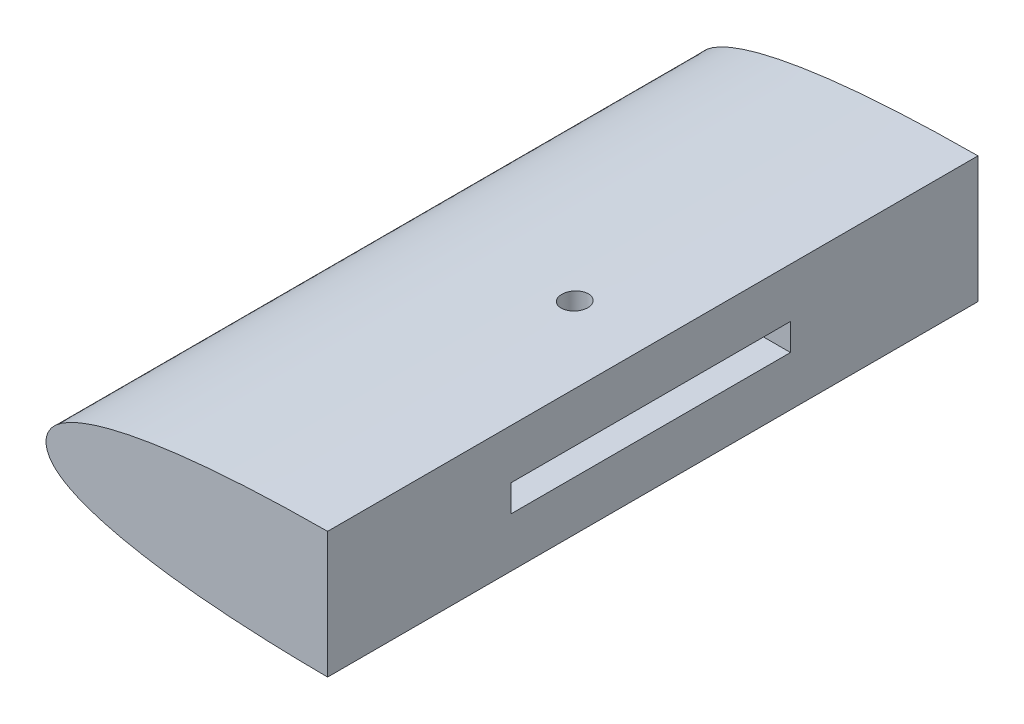
ISO-10303-21;
HEADER;
FILE_DESCRIPTION(('STEP AP214'),'2;1');
FILE_NAME('part.step','',(''),(''),'','','');
FILE_SCHEMA(('AUTOMOTIVE_DESIGN { 1 0 10303 214 1 1 1 1 }'));
ENDSEC;
DATA;
#1=APPLICATION_CONTEXT('core data for automotive mechanical design processes');
#2=APPLICATION_PROTOCOL_DEFINITION('international standard','automotive_design',2000,#1);
#3=PRODUCT_CONTEXT('',#1,'mechanical');
#4=PRODUCT('Part','Part','',(#3));
#5=PRODUCT_RELATED_PRODUCT_CATEGORY('part','',(#4));
#6=PRODUCT_DEFINITION_FORMATION('','',#4);
#7=PRODUCT_DEFINITION_CONTEXT('part definition',#1,'design');
#8=PRODUCT_DEFINITION('design','',#6,#7);
#9=PRODUCT_DEFINITION_SHAPE('','',#8);
#10=(LENGTH_UNIT() NAMED_UNIT(*) SI_UNIT(.MILLI.,.METRE.));
#11=(NAMED_UNIT(*) PLANE_ANGLE_UNIT() SI_UNIT($,.RADIAN.));
#12=(NAMED_UNIT(*) SI_UNIT($,.STERADIAN.) SOLID_ANGLE_UNIT());
#13=UNCERTAINTY_MEASURE_WITH_UNIT(LENGTH_MEASURE(1.E-05),#10,'distance_accuracy_value','');
#14=(GEOMETRIC_REPRESENTATION_CONTEXT(3) GLOBAL_UNCERTAINTY_ASSIGNED_CONTEXT((#13)) GLOBAL_UNIT_ASSIGNED_CONTEXT((#10,
#11,#12)) REPRESENTATION_CONTEXT('',''));
#15=CARTESIAN_POINT('',(0.,0.,0.));
#16=DIRECTION('',(0.,0.,1.));
#17=DIRECTION('',(1.,0.,0.));
#18=AXIS2_PLACEMENT_3D('',#15,#16,#17);
#19=CARTESIAN_POINT('',(30.9490601417906,3.10353900169913,106.75));
#20=DIRECTION('',(0.,1.,0.));
#21=DIRECTION('',(0.,0.,1.));
#22=AXIS2_PLACEMENT_3D('',#19,#20,#21);
#23=PLANE('',#22);
#24=CARTESIAN_POINT('',(46.9490601417906,3.10353900169913,75.));
#25=DIRECTION('',(0.,1.,0.));
#26=DIRECTION('',(0.,0.,1.));
#27=AXIS2_PLACEMENT_3D('',#24,#25,#26);
#28=CIRCLE('',#27,3.);
#29=CARTESIAN_POINT('',(46.9490601417906,3.10353900169913,78.));
#30=VERTEX_POINT('',#29);
#31=EDGE_CURVE('E150',#30,#30,#28,.T.);
#32=ORIENTED_EDGE('',*,*,#31,.T.);
#33=EDGE_LOOP('',(#32));
#34=FACE_BOUND('',#33,.T.);
#35=DIRECTION('',(0.,0.,1.));
#36=VECTOR('',#35,1.);
#37=CARTESIAN_POINT('',(64.9490601417906,3.10353900169913,106.75));
#38=LINE('',#37,#36);
#39=CARTESIAN_POINT('',(64.9490601417906,3.10353900169913,43.25));
#40=VERTEX_POINT('',#39);
#41=CARTESIAN_POINT('',(64.9490601417906,3.10353900169913,107.75));
#42=VERTEX_POINT('',#41);
#43=EDGE_CURVE('E113',#40,#42,#38,.T.);
#44=ORIENTED_EDGE('',*,*,#43,.T.);
#45=DIRECTION('',(1.,0.,0.));
#46=VECTOR('',#45,1.);
#47=CARTESIAN_POINT('',(64.9490601417906,3.10353900169913,107.75));
#48=LINE('',#47,#46);
#49=CARTESIAN_POINT('',(35.9490601417906,3.10353900169913,107.75));
#50=VERTEX_POINT('',#49);
#51=EDGE_CURVE('E141',#50,#42,#48,.T.);
#52=ORIENTED_EDGE('',*,*,#51,.F.);
#53=DIRECTION('',(0.,0.,1.));
#54=VECTOR('',#53,1.);
#55=CARTESIAN_POINT('',(35.9490601417906,3.10353900169913,43.25));
#56=LINE('',#55,#54);
#57=CARTESIAN_POINT('',(35.9490601417906,3.10353900169913,43.25));
#58=VERTEX_POINT('',#57);
#59=EDGE_CURVE('E131',#58,#50,#56,.T.);
#60=ORIENTED_EDGE('',*,*,#59,.F.);
#61=DIRECTION('',(1.,0.,0.));
#62=VECTOR('',#61,1.);
#63=CARTESIAN_POINT('',(30.9490601417906,3.10353900169913,43.25));
#64=LINE('',#63,#62);
#65=EDGE_CURVE('E112',#58,#40,#64,.T.);
#66=ORIENTED_EDGE('',*,*,#65,.T.);
#67=EDGE_LOOP('',(#44,#52,#60,#66));
#68=FACE_BOUND('',#67,.T.);
#69=ADVANCED_FACE('F42',(#34,#68),#23,.F.);
#70=CARTESIAN_POINT('',(30.9490601417906,3.10353900169913,43.25));
#71=DIRECTION('',(0.,0.,-1.));
#72=DIRECTION('',(-1.,0.,0.));
#73=AXIS2_PLACEMENT_3D('',#70,#71,#72);
#74=PLANE('',#73);
#75=ORIENTED_EDGE('',*,*,#65,.F.);
#76=DIRECTION('',(0.,-1.,0.));
#77=VECTOR('',#76,1.);
#78=CARTESIAN_POINT('',(35.9490601417906,3.10353900169913,43.25));
#79=LINE('',#78,#77);
#80=CARTESIAN_POINT('',(35.9490601417906,-3.10353900169913,43.25));
#81=VERTEX_POINT('',#80);
#82=EDGE_CURVE('E119',#58,#81,#79,.T.);
#83=ORIENTED_EDGE('',*,*,#82,.T.);
#84=DIRECTION('',(1.,0.,0.));
#85=VECTOR('',#84,1.);
#86=CARTESIAN_POINT('',(30.9490601417906,-3.10353900169913,43.25));
#87=LINE('',#86,#85);
#88=CARTESIAN_POINT('',(64.9490601417906,-3.10353900169913,43.25));
#89=VERTEX_POINT('',#88);
#90=EDGE_CURVE('E100',#81,#89,#87,.T.);
#91=ORIENTED_EDGE('',*,*,#90,.T.);
#92=DIRECTION('',(0.,1.,0.));
#93=VECTOR('',#92,1.);
#94=CARTESIAN_POINT('',(64.9490601417906,3.10353900169913,43.25));
#95=LINE('',#94,#93);
#96=EDGE_CURVE('E156',#89,#40,#95,.T.);
#97=ORIENTED_EDGE('',*,*,#96,.T.);
#98=EDGE_LOOP('',(#75,#83,#91,#97));
#99=FACE_BOUND('',#98,.T.);
#100=ADVANCED_FACE('F125',(#99),#74,.F.);
#101=CARTESIAN_POINT('',(30.9490601417906,-3.10353900169913,106.75));
#102=DIRECTION('',(0.,-1.,0.));
#103=DIRECTION('',(0.,0.,-1.));
#104=AXIS2_PLACEMENT_3D('',#101,#102,#103);
#105=PLANE('',#104);
#106=CARTESIAN_POINT('',(46.9490601417906,-3.10353900169913,75.));
#107=DIRECTION('',(0.,-1.,0.));
#108=DIRECTION('',(0.,0.,-1.));
#109=AXIS2_PLACEMENT_3D('',#106,#107,#108);
#110=CIRCLE('',#109,3.);
#111=CARTESIAN_POINT('',(46.9490601417906,-3.10353900169913,72.));
#112=VERTEX_POINT('',#111);
#113=EDGE_CURVE('E146',#112,#112,#110,.T.);
#114=ORIENTED_EDGE('',*,*,#113,.T.);
#115=EDGE_LOOP('',(#114));
#116=FACE_BOUND('',#115,.T.);
#117=ORIENTED_EDGE('',*,*,#90,.F.);
#118=DIRECTION('',(0.,0.,1.));
#119=VECTOR('',#118,1.);
#120=CARTESIAN_POINT('',(35.9490601417906,-3.10353900169913,43.25));
#121=LINE('',#120,#119);
#122=CARTESIAN_POINT('',(35.9490601417906,-3.10353900169913,107.75));
#123=VERTEX_POINT('',#122);
#124=EDGE_CURVE('E104',#81,#123,#121,.T.);
#125=ORIENTED_EDGE('',*,*,#124,.T.);
#126=DIRECTION('',(-1.,0.,0.));
#127=VECTOR('',#126,1.);
#128=CARTESIAN_POINT('',(64.9490601417906,-3.10353900169913,107.75));
#129=LINE('',#128,#127);
#130=CARTESIAN_POINT('',(64.9490601417906,-3.10353900169913,107.75));
#131=VERTEX_POINT('',#130);
#132=EDGE_CURVE('E138',#131,#123,#129,.T.);
#133=ORIENTED_EDGE('',*,*,#132,.F.);
#134=DIRECTION('',(0.,0.,-1.));
#135=VECTOR('',#134,1.);
#136=CARTESIAN_POINT('',(64.9490601417906,-3.10353900169913,106.75));
#137=LINE('',#136,#135);
#138=EDGE_CURVE('E106',#131,#89,#137,.T.);
#139=ORIENTED_EDGE('',*,*,#138,.T.);
#140=EDGE_LOOP('',(#117,#125,#133,#139));
#141=FACE_BOUND('',#140,.T.);
#142=ADVANCED_FACE('F102',(#116,#141),#105,.F.);
#143=CARTESIAN_POINT('',(64.9490601417906,14.5585390016991,150.01));
#144=DIRECTION('',(1.,0.,0.));
#145=DIRECTION('',(0.,0.,-1.));
#146=AXIS2_PLACEMENT_3D('',#143,#144,#145);
#147=PLANE('',#146);
#148=DIRECTION('',(0.,-1.,0.));
#149=VECTOR('',#148,1.);
#150=CARTESIAN_POINT('',(64.9490601417906,-3.10353900169913,107.75));
#151=LINE('',#150,#149);
#152=EDGE_CURVE('E134',#42,#131,#151,.T.);
#153=ORIENTED_EDGE('',*,*,#152,.F.);
#154=ORIENTED_EDGE('',*,*,#43,.F.);
#155=ORIENTED_EDGE('',*,*,#96,.F.);
#156=ORIENTED_EDGE('',*,*,#138,.F.);
#157=EDGE_LOOP('',(#153,#154,#155,#156));
#158=FACE_BOUND('',#157,.T.);
#159=DIRECTION('',(0.,1.,0.));
#160=VECTOR('',#159,1.);
#161=CARTESIAN_POINT('',(64.9490601417906,2.03901631355602E-13,150.));
#162=LINE('',#161,#160);
#163=CARTESIAN_POINT('',(64.9490601417907,-14.5585390016991,150.));
#164=VERTEX_POINT('',#163);
#165=CARTESIAN_POINT('',(64.9490601417906,14.5585390016991,150.));
#166=VERTEX_POINT('',#165);
#167=EDGE_CURVE('E63',#164,#166,#162,.T.);
#168=ORIENTED_EDGE('',*,*,#167,.F.);
#169=DIRECTION('',(0.,0.,-1.));
#170=VECTOR('',#169,1.);
#171=CARTESIAN_POINT('',(64.9490601417906,-14.5585390016991,150.));
#172=LINE('',#171,#170);
#173=CARTESIAN_POINT('',(64.9490601417907,-14.5585390016991,0.));
#174=VERTEX_POINT('',#173);
#175=EDGE_CURVE('E222',#164,#174,#172,.T.);
#176=ORIENTED_EDGE('',*,*,#175,.T.);
#177=DIRECTION('',(0.,1.,0.));
#178=VECTOR('',#177,1.);
#179=CARTESIAN_POINT('',(64.9490601417906,2.03901631355602E-13,0.));
#180=LINE('',#179,#178);
#181=CARTESIAN_POINT('',(64.9490601417906,14.5585390016991,0.));
#182=VERTEX_POINT('',#181);
#183=EDGE_CURVE('E162',#174,#182,#180,.T.);
#184=ORIENTED_EDGE('',*,*,#183,.T.);
#185=DIRECTION('',(0.,0.,-1.));
#186=VECTOR('',#185,1.);
#187=CARTESIAN_POINT('',(64.9490601417906,14.5585390016991,150.));
#188=LINE('',#187,#186);
#189=EDGE_CURVE('E220',#182,#166,#188,.F.);
#190=ORIENTED_EDGE('',*,*,#189,.T.);
#191=EDGE_LOOP('',(#168,#176,#184,#190));
#192=FACE_BOUND('',#191,.T.);
#193=ADVANCED_FACE('F196',(#158,#192),#147,.T.);
#194=CARTESIAN_POINT('',(0.,2.03901631355602E-13,0.));
#195=DIRECTION('',(0.,0.,1.));
#196=DIRECTION('',(1.,0.,0.));
#197=AXIS2_PLACEMENT_3D('',#194,#195,#196);
#198=PLANE('',#197);
#199=ORIENTED_EDGE('',*,*,#183,.F.);
#200=CARTESIAN_POINT('',(300.,0.615,0.));
#201=CARTESIAN_POINT('',(297.904984083785,0.75175754308859,0.));
#202=CARTESIAN_POINT('',(292.317834146917,1.11647310076999,0.));
#203=CARTESIAN_POINT('',(283.239167485548,1.717548993117,0.));
#204=CARTESIAN_POINT('',(272.76385107331,2.40173412883395,0.));
#205=CARTESIAN_POINT('',(262.289009769235,3.09314837150869,0.));
#206=CARTESIAN_POINT('',(251.814135815064,3.78406655140474,0.));
#207=CARTESIAN_POINT('',(241.337843931188,4.46862529985887,0.));
#208=CARTESIAN_POINT('',(230.862161265605,5.16145375899976,0.));
#209=CARTESIAN_POINT('',(220.385838201456,5.84553816170969,0.));
#210=CARTESIAN_POINT('',(209.911154414138,6.53834924156426,0.));
#211=CARTESIAN_POINT('',(199.435845553229,7.22265025326787,0.));
#212=CARTESIAN_POINT('',(188.961161961777,7.91546436518573,0.));
#213=CARTESIAN_POINT('',(178.484838114123,8.59953663901671,0.));
#214=CARTESIAN_POINT('',(168.010154067309,9.29234472619852,0.));
#215=CARTESIAN_POINT('',(157.534847027507,9.97666983236351,0.));
#216=CARTESIAN_POINT('',(147.06015640951,10.6693905377389,0.));
#217=CARTESIAN_POINT('',(136.583858847943,11.3538123568298,0.));
#218=CARTESIAN_POINT('',(126.108081002565,12.0453815229781,0.));
#219=CARTESIAN_POINT('',(115.628989204461,12.7348475775842,0.));
#220=CARTESIAN_POINT('',(106.544413863488,13.3187717638727,0.));
#221=CARTESIAN_POINT('',(98.151476206991,13.7592616634662,0.));
#222=CARTESIAN_POINT('',(91.1565623688358,14.0750535449349,0.));
#223=CARTESIAN_POINT('',(83.4590911030426,14.3326710084469,0.));
#224=CARTESIAN_POINT('',(76.8097627687469,14.4942663264378,0.));
#225=CARTESIAN_POINT('',(71.208103954924,14.5530438963208,0.));
#226=CARTESIAN_POINT('',(68.0570107705436,14.5648415354949,0.));
#227=CARTESIAN_POINT('',(65.9559846118634,14.5661361460291,0.));
#228=CARTESIAN_POINT('',(63.5049428575731,14.5483076615896,0.));
#229=CARTESIAN_POINT('',(58.9501852432483,14.5072274097355,0.));
#230=CARTESIAN_POINT('',(52.6393729328738,14.3421780252763,0.));
#231=CARTESIAN_POINT('',(45.9763950033585,14.0411696911552,0.));
#232=CARTESIAN_POINT('',(40.7142788662388,13.6942708963401,0.));
#233=CARTESIAN_POINT('',(36.8531486122309,13.3715858694841,0.));
#234=CARTESIAN_POINT('',(33.6905280026766,13.0667563353647,0.));
#235=CARTESIAN_POINT('',(30.5256864431676,12.7135928826588,0.));
#236=CARTESIAN_POINT('',(27.3574246256501,12.304603807145,0.));
#237=CARTESIAN_POINT('',(23.8293477768756,11.7731450606675,0.));
#238=CARTESIAN_POINT('',(20.2934490427705,11.1558108117877,0.));
#239=CARTESIAN_POINT('',(16.7526134925339,10.4050388087684,0.));
#240=CARTESIAN_POINT('',(13.9101456800867,9.69526837778904,0.));
#241=CARTESIAN_POINT('',(11.411898728501,8.96894267593932,0.));
#242=CARTESIAN_POINT('',(9.247069544107,8.23912232844403,0.));
#243=CARTESIAN_POINT('',(7.0471016636079,7.37156353291515,0.));
#244=CARTESIAN_POINT('',(5.20436825337569,6.46929823591286,0.));
#245=CARTESIAN_POINT('',(3.70440686726622,5.56696021824286,0.));
#246=CARTESIAN_POINT('',(2.49240630636274,4.6717641181702,0.));
#247=CARTESIAN_POINT('',(0.823776107687222,3.08438944362807,0.));
#248=CARTESIAN_POINT('',(-0.563560510684523,0.,0.));
#249=CARTESIAN_POINT('',(0.823776107687273,-3.08438944362815,0.));
#250=CARTESIAN_POINT('',(2.49240630636272,-4.67176411817019,0.));
#251=CARTESIAN_POINT('',(3.70440686726622,-5.56696021824286,0.));
#252=CARTESIAN_POINT('',(5.20436825337569,-6.46929823591286,0.));
#253=CARTESIAN_POINT('',(7.04710166360792,-7.37156353291516,0.));
#254=CARTESIAN_POINT('',(9.24706954410698,-8.23912232844402,0.));
#255=CARTESIAN_POINT('',(11.411898728501,-8.96894267593932,0.));
#256=CARTESIAN_POINT('',(13.9101456800867,-9.69526837778906,0.));
#257=CARTESIAN_POINT('',(16.7526134925338,-10.4050388087684,0.));
#258=CARTESIAN_POINT('',(20.2934490427705,-11.1558108117877,0.));
#259=CARTESIAN_POINT('',(23.8293477768757,-11.7731450606675,0.));
#260=CARTESIAN_POINT('',(27.35742462565,-12.304603807145,0.));
#261=CARTESIAN_POINT('',(30.5256864431676,-12.7135928826588,0.));
#262=CARTESIAN_POINT('',(33.6905280026766,-13.0667563353647,0.));
#263=CARTESIAN_POINT('',(36.8531486122309,-13.3715858694841,0.));
#264=CARTESIAN_POINT('',(40.7142788662388,-13.6942708963401,0.));
#265=CARTESIAN_POINT('',(45.9763950033586,-14.0411696911552,0.));
#266=CARTESIAN_POINT('',(52.6393729328738,-14.3421780252763,0.));
#267=CARTESIAN_POINT('',(58.9501852432483,-14.5072274097355,0.));
#268=CARTESIAN_POINT('',(63.5049428575731,-14.5483076615896,0.));
#269=CARTESIAN_POINT('',(65.9559846118633,-14.5661361460291,0.));
#270=CARTESIAN_POINT('',(68.0570107705436,-14.5648415354949,0.));
#271=CARTESIAN_POINT('',(71.208103954924,-14.5530438963208,0.));
#272=CARTESIAN_POINT('',(76.8097627687469,-14.4942663264378,0.));
#273=CARTESIAN_POINT('',(83.4590911030426,-14.3326710084469,0.));
#274=CARTESIAN_POINT('',(91.1565623688358,-14.0750535449349,0.));
#275=CARTESIAN_POINT('',(98.151476206991,-13.7592616634662,0.));
#276=CARTESIAN_POINT('',(106.544413863488,-13.3187717638727,0.));
#277=CARTESIAN_POINT('',(115.628989204461,-12.7348475775842,0.));
#278=CARTESIAN_POINT('',(126.108081002565,-12.0453815229782,0.));
#279=CARTESIAN_POINT('',(136.583858847943,-11.3538123568298,0.));
#280=CARTESIAN_POINT('',(147.06015640951,-10.6693905377389,0.));
#281=CARTESIAN_POINT('',(157.534847027507,-9.97666983236352,0.));
#282=CARTESIAN_POINT('',(168.010154067309,-9.29234472619851,0.));
#283=CARTESIAN_POINT('',(178.484838114123,-8.59953663901672,0.));
#284=CARTESIAN_POINT('',(188.961161961777,-7.91546436518573,0.));
#285=CARTESIAN_POINT('',(199.435845553229,-7.22265025326786,0.));
#286=CARTESIAN_POINT('',(209.911154414138,-6.53834924156426,0.));
#287=CARTESIAN_POINT('',(220.385838201456,-5.84553816170969,0.));
#288=CARTESIAN_POINT('',(230.862161265605,-5.16145375899976,0.));
#289=CARTESIAN_POINT('',(241.337843931188,-4.46862529985887,0.));
#290=CARTESIAN_POINT('',(251.814135815064,-3.78406655140474,0.));
#291=CARTESIAN_POINT('',(262.289009769236,-3.09314837150869,0.));
#292=CARTESIAN_POINT('',(272.76385107331,-2.40173412883395,0.));
#293=CARTESIAN_POINT('',(283.239167485548,-1.71754899311699,0.));
#294=CARTESIAN_POINT('',(292.317834146917,-1.11647310077,0.));
#295=CARTESIAN_POINT('',(297.904984083785,-0.75175754308859,0.));
#296=CARTESIAN_POINT('',(300.,-0.615,0.));
#297=B_SPLINE_CURVE_WITH_KNOTS('',3,(#200,#201,#202,#203,#204,#205,#206,#207,#208,#209,#210,
#211,#212,#213,#214,#215,#216,#217,#218,#219,#220,#221,#222,#223,#224,#225,#226,#227,#228,#229,
#230,#231,#232,#233,#234,#235,#236,#237,#238,#239,#240,#241,#242,#243,#244,#245,#246,#247,#248,
#249,#250,#251,#252,#253,#254,#255,#256,#257,#258,#259,#260,#261,#262,#263,#264,#265,#266,#267,
#268,#269,#270,#271,#272,#273,#274,#275,#276,#277,#278,#279,#280,#281,#282,#283,#284,#285,#286,
#287,#288,#289,#290,#291,#292,#293,#294,#295,#296),.UNSPECIFIED.,.F.,.F.,(4,1,1,1,1,1,1,1,1,1,1,
1,1,1,1,1,1,1,1,1,1,1,1,1,1,1,1,1,1,1,1,1,1,1,1,1,1,1,1,1,1,1,1,1,1,1,1,1,1,1,1,1,1,1,1,1,1,1,1,
1,1,1,1,1,1,1,1,1,1,1,1,1,1,1,1,1,1,1,1,1,1,1,1,1,1,1,1,1,1,1,1,1,1,1,4),(0.,0.0103317667258092,
0.0275535519148415,0.0447750143759933,0.0619918890878921,0.0792136742769245,0.0964351367380763,
0.113656921927109,0.13087838438826,0.148100169577293,0.165316721469263,0.182538506658296,
0.199759969119447,0.21698175430848,0.23419830620045,0.251420091389483,0.268641553850634,
0.285863339039667,0.303084801500818,0.320322147091687,0.330661096781363,0.344443905301423,
0.354779243630488,0.368562091684667,0.377174559088726,0.382346693571461,0.384069085539591,
0.387513925716762,0.394408809862741,0.406484297575228,0.418578438098915,0.427229264414947,
0.432434171748687,0.437645263639366,0.442864528340028,0.448104781667718,0.453364927121588,
0.460421620890769,0.465764878525566,0.47117403778509,0.474835155867093,0.478565393973049,
0.482412614605373,0.486466494475071,0.488643966308192,0.49102188077919,0.493857902158305,0.5,
0.506142097841696,0.50897811922081,0.511356033691808,0.513533505524929,0.517587385394628,
0.521434606026952,0.525164844132907,0.52882596221491,0.534235121474435,0.539578379109231,
0.546635072878412,0.551895218332282,0.557135471659973,0.562354736360635,0.567565828251314,
0.572770735585054,0.581421561901085,0.593515702424773,0.605591190137259,0.612486074283239,
0.615930914460409,0.617653306428539,0.622825440911274,0.631437908315334,0.645220756369513,
0.655556094698577,0.669338903218637,0.679677852908314,0.696915198499182,0.714136660960334,
0.731358446149366,0.748579908610518,0.76580169379955,0.783018245691521,0.800240030880553,
0.817461493341705,0.834683278530737,0.851899830422708,0.86912161561174,0.886343078072892,
0.903564863261924,0.920786325723076,0.938008110912108,0.955224985624007,0.972446448085159,
0.989668233274191,1.),.UNSPECIFIED.);
#298=EDGE_CURVE('E12',#182,#174,#297,.T.);
#299=ORIENTED_EDGE('',*,*,#298,.F.);
#300=EDGE_LOOP('',(#199,#299));
#301=FACE_BOUND('',#300,.T.);
#302=ADVANCED_FACE('F177',(#301),#198,.F.);
#303=CARTESIAN_POINT('',(300.,0.615,150.));
#304=CARTESIAN_POINT('',(297.904984083785,0.75175754308859,150.));
#305=CARTESIAN_POINT('',(292.317834146917,1.11647310076999,150.));
#306=CARTESIAN_POINT('',(283.239167485548,1.717548993117,150.));
#307=CARTESIAN_POINT('',(272.76385107331,2.40173412883395,150.));
#308=CARTESIAN_POINT('',(262.289009769235,3.09314837150869,150.));
#309=CARTESIAN_POINT('',(251.814135815064,3.78406655140474,150.));
#310=CARTESIAN_POINT('',(241.337843931188,4.46862529985887,150.));
#311=CARTESIAN_POINT('',(230.862161265605,5.16145375899976,150.));
#312=CARTESIAN_POINT('',(220.385838201456,5.84553816170969,150.));
#313=CARTESIAN_POINT('',(209.911154414138,6.53834924156426,150.));
#314=CARTESIAN_POINT('',(199.435845553229,7.22265025326787,150.));
#315=CARTESIAN_POINT('',(188.961161961777,7.91546436518573,150.));
#316=CARTESIAN_POINT('',(178.484838114123,8.59953663901671,150.));
#317=CARTESIAN_POINT('',(168.010154067309,9.29234472619852,150.));
#318=CARTESIAN_POINT('',(157.534847027507,9.97666983236351,150.));
#319=CARTESIAN_POINT('',(147.06015640951,10.6693905377389,150.));
#320=CARTESIAN_POINT('',(136.583858847943,11.3538123568298,150.));
#321=CARTESIAN_POINT('',(126.108081002565,12.0453815229781,150.));
#322=CARTESIAN_POINT('',(115.628989204461,12.7348475775842,150.));
#323=CARTESIAN_POINT('',(106.544413863488,13.3187717638727,150.));
#324=CARTESIAN_POINT('',(98.151476206991,13.7592616634662,150.));
#325=CARTESIAN_POINT('',(91.1565623688358,14.0750535449349,150.));
#326=CARTESIAN_POINT('',(83.4590911030426,14.3326710084469,150.));
#327=CARTESIAN_POINT('',(76.8097627687469,14.4942663264378,150.));
#328=CARTESIAN_POINT('',(71.208103954924,14.5530438963208,150.));
#329=CARTESIAN_POINT('',(68.0570107705436,14.5648415354949,150.));
#330=CARTESIAN_POINT('',(65.9559846118634,14.5661361460291,150.));
#331=CARTESIAN_POINT('',(63.5049428575731,14.5483076615896,150.));
#332=CARTESIAN_POINT('',(58.9501852432483,14.5072274097355,150.));
#333=CARTESIAN_POINT('',(52.6393729328738,14.3421780252763,150.));
#334=CARTESIAN_POINT('',(45.9763950033585,14.0411696911552,150.));
#335=CARTESIAN_POINT('',(40.7142788662388,13.6942708963401,150.));
#336=CARTESIAN_POINT('',(36.8531486122309,13.3715858694841,150.));
#337=CARTESIAN_POINT('',(33.6905280026766,13.0667563353647,150.));
#338=CARTESIAN_POINT('',(30.5256864431676,12.7135928826588,150.));
#339=CARTESIAN_POINT('',(27.3574246256501,12.304603807145,150.));
#340=CARTESIAN_POINT('',(23.8293477768756,11.7731450606675,150.));
#341=CARTESIAN_POINT('',(20.2934490427705,11.1558108117877,150.));
#342=CARTESIAN_POINT('',(16.7526134925339,10.4050388087684,150.));
#343=CARTESIAN_POINT('',(13.9101456800867,9.69526837778904,150.));
#344=CARTESIAN_POINT('',(11.411898728501,8.96894267593932,150.));
#345=CARTESIAN_POINT('',(9.247069544107,8.23912232844403,150.));
#346=CARTESIAN_POINT('',(7.0471016636079,7.37156353291515,150.));
#347=CARTESIAN_POINT('',(5.20436825337569,6.46929823591286,150.));
#348=CARTESIAN_POINT('',(3.70440686726622,5.56696021824286,150.));
#349=CARTESIAN_POINT('',(2.49240630636274,4.6717641181702,150.));
#350=CARTESIAN_POINT('',(0.823776107687222,3.08438944362807,150.));
#351=CARTESIAN_POINT('',(-0.563560510684523,0.,150.));
#352=CARTESIAN_POINT('',(0.823776107687273,-3.08438944362815,150.));
#353=CARTESIAN_POINT('',(2.49240630636272,-4.67176411817019,150.));
#354=CARTESIAN_POINT('',(3.70440686726622,-5.56696021824286,150.));
#355=CARTESIAN_POINT('',(5.20436825337569,-6.46929823591286,150.));
#356=CARTESIAN_POINT('',(7.04710166360792,-7.37156353291516,150.));
#357=CARTESIAN_POINT('',(9.24706954410698,-8.23912232844402,150.));
#358=CARTESIAN_POINT('',(11.411898728501,-8.96894267593932,150.));
#359=CARTESIAN_POINT('',(13.9101456800867,-9.69526837778906,150.));
#360=CARTESIAN_POINT('',(16.7526134925338,-10.4050388087684,150.));
#361=CARTESIAN_POINT('',(20.2934490427705,-11.1558108117877,150.));
#362=CARTESIAN_POINT('',(23.8293477768757,-11.7731450606675,150.));
#363=CARTESIAN_POINT('',(27.35742462565,-12.304603807145,150.));
#364=CARTESIAN_POINT('',(30.5256864431676,-12.7135928826588,150.));
#365=CARTESIAN_POINT('',(33.6905280026766,-13.0667563353647,150.));
#366=CARTESIAN_POINT('',(36.8531486122309,-13.3715858694841,150.));
#367=CARTESIAN_POINT('',(40.7142788662388,-13.6942708963401,150.));
#368=CARTESIAN_POINT('',(45.9763950033586,-14.0411696911552,150.));
#369=CARTESIAN_POINT('',(52.6393729328738,-14.3421780252763,150.));
#370=CARTESIAN_POINT('',(58.9501852432483,-14.5072274097355,150.));
#371=CARTESIAN_POINT('',(63.5049428575731,-14.5483076615896,150.));
#372=CARTESIAN_POINT('',(65.9559846118633,-14.5661361460291,150.));
#373=CARTESIAN_POINT('',(68.0570107705436,-14.5648415354949,150.));
#374=CARTESIAN_POINT('',(71.208103954924,-14.5530438963208,150.));
#375=CARTESIAN_POINT('',(76.8097627687469,-14.4942663264378,150.));
#376=CARTESIAN_POINT('',(83.4590911030426,-14.3326710084469,150.));
#377=CARTESIAN_POINT('',(91.1565623688358,-14.0750535449349,150.));
#378=CARTESIAN_POINT('',(98.151476206991,-13.7592616634662,150.));
#379=CARTESIAN_POINT('',(106.544413863488,-13.3187717638727,150.));
#380=CARTESIAN_POINT('',(115.628989204461,-12.7348475775842,150.));
#381=CARTESIAN_POINT('',(126.108081002565,-12.0453815229782,150.));
#382=CARTESIAN_POINT('',(136.583858847943,-11.3538123568298,150.));
#383=CARTESIAN_POINT('',(147.06015640951,-10.6693905377389,150.));
#384=CARTESIAN_POINT('',(157.534847027507,-9.97666983236352,150.));
#385=CARTESIAN_POINT('',(168.010154067309,-9.29234472619851,150.));
#386=CARTESIAN_POINT('',(178.484838114123,-8.59953663901672,150.));
#387=CARTESIAN_POINT('',(188.961161961777,-7.91546436518573,150.));
#388=CARTESIAN_POINT('',(199.435845553229,-7.22265025326786,150.));
#389=CARTESIAN_POINT('',(209.911154414138,-6.53834924156426,150.));
#390=CARTESIAN_POINT('',(220.385838201456,-5.84553816170969,150.));
#391=CARTESIAN_POINT('',(230.862161265605,-5.16145375899976,150.));
#392=CARTESIAN_POINT('',(241.337843931188,-4.46862529985887,150.));
#393=CARTESIAN_POINT('',(251.814135815064,-3.78406655140474,150.));
#394=CARTESIAN_POINT('',(262.289009769236,-3.09314837150869,150.));
#395=CARTESIAN_POINT('',(272.76385107331,-2.40173412883395,150.));
#396=CARTESIAN_POINT('',(283.239167485548,-1.71754899311699,150.));
#397=CARTESIAN_POINT('',(292.317834146917,-1.11647310077,150.));
#398=CARTESIAN_POINT('',(297.904984083785,-0.75175754308859,150.));
#399=CARTESIAN_POINT('',(300.,-0.615,150.));
#400=B_SPLINE_CURVE_WITH_KNOTS('',3,(#303,#304,#305,#306,#307,#308,#309,#310,#311,#312,#313,
#314,#315,#316,#317,#318,#319,#320,#321,#322,#323,#324,#325,#326,#327,#328,#329,#330,#331,#332,
#333,#334,#335,#336,#337,#338,#339,#340,#341,#342,#343,#344,#345,#346,#347,#348,#349,#350,#351,
#352,#353,#354,#355,#356,#357,#358,#359,#360,#361,#362,#363,#364,#365,#366,#367,#368,#369,#370,
#371,#372,#373,#374,#375,#376,#377,#378,#379,#380,#381,#382,#383,#384,#385,#386,#387,#388,#389,
#390,#391,#392,#393,#394,#395,#396,#397,#398,#399),.UNSPECIFIED.,.F.,.F.,(4,1,1,1,1,1,1,1,1,1,1,
1,1,1,1,1,1,1,1,1,1,1,1,1,1,1,1,1,1,1,1,1,1,1,1,1,1,1,1,1,1,1,1,1,1,1,1,1,1,1,1,1,1,1,1,1,1,1,1,
1,1,1,1,1,1,1,1,1,1,1,1,1,1,1,1,1,1,1,1,1,1,1,1,1,1,1,1,1,1,1,1,1,1,1,4),(0.,0.0103317667258092,
0.0275535519148415,0.0447750143759933,0.0619918890878921,0.0792136742769245,0.0964351367380763,
0.113656921927109,0.13087838438826,0.148100169577293,0.165316721469263,0.182538506658296,
0.199759969119447,0.21698175430848,0.23419830620045,0.251420091389483,0.268641553850634,
0.285863339039667,0.303084801500818,0.320322147091687,0.330661096781363,0.344443905301423,
0.354779243630488,0.368562091684667,0.377174559088726,0.382346693571461,0.384069085539591,
0.387513925716762,0.394408809862741,0.406484297575228,0.418578438098915,0.427229264414947,
0.432434171748687,0.437645263639366,0.442864528340028,0.448104781667718,0.453364927121588,
0.460421620890769,0.465764878525566,0.47117403778509,0.474835155867093,0.478565393973049,
0.482412614605373,0.486466494475071,0.488643966308192,0.49102188077919,0.493857902158305,0.5,
0.506142097841696,0.50897811922081,0.511356033691808,0.513533505524929,0.517587385394628,
0.521434606026952,0.525164844132907,0.52882596221491,0.534235121474435,0.539578379109231,
0.546635072878412,0.551895218332282,0.557135471659973,0.562354736360635,0.567565828251314,
0.572770735585054,0.581421561901085,0.593515702424773,0.605591190137259,0.612486074283239,
0.615930914460409,0.617653306428539,0.622825440911274,0.631437908315334,0.645220756369513,
0.655556094698577,0.669338903218637,0.679677852908314,0.696915198499182,0.714136660960334,
0.731358446149366,0.748579908610518,0.76580169379955,0.783018245691521,0.800240030880553,
0.817461493341705,0.834683278530737,0.851899830422708,0.86912161561174,0.886343078072892,
0.903564863261924,0.920786325723076,0.938008110912108,0.955224985624007,0.972446448085159,
0.989668233274191,1.),.UNSPECIFIED.);
#401=DIRECTION('',(0.,0.,-1.));
#402=VECTOR('',#401,1.);
#403=SURFACE_OF_LINEAR_EXTRUSION('',#400,#402);
#404=CARTESIAN_POINT('',(46.9490601417906,-14.0711285614268,78.));
#405=CARTESIAN_POINT('',(47.1176860867755,-14.0798818583987,77.9999925581094));
#406=CARTESIAN_POINT('',(47.2864407894336,-14.0885074421067,77.9857352975402));
#407=CARTESIAN_POINT('',(47.6193193276599,-14.1052673954628,77.9290480526229));
#408=CARTESIAN_POINT('',(47.7834373752457,-14.1134011644597,77.8865843489561));
#409=CARTESIAN_POINT('',(48.1021741949816,-14.1289717698698,77.7746768534883));
#410=CARTESIAN_POINT('',(48.256797085028,-14.1364089091457,77.7052448544769));
#411=CARTESIAN_POINT('',(48.5521590574651,-14.150427405083,77.5413764013468));
#412=CARTESIAN_POINT('',(48.692901602822,-14.1570089753288,77.4469462057254));
#413=CARTESIAN_POINT('',(48.9564537645091,-14.1691891042293,77.2358131688068));
#414=CARTESIAN_POINT('',(49.079274691274,-14.1747882833322,77.1191244832087));
#415=CARTESIAN_POINT('',(49.3035865296712,-14.1849139602743,76.8667378732675));
#416=CARTESIAN_POINT('',(49.4050767197687,-14.1894404218283,76.7310393061537));
#417=CARTESIAN_POINT('',(49.5837222046167,-14.1973478248894,76.4446481800066));
#418=CARTESIAN_POINT('',(49.6609039123254,-14.2007300100358,76.2939721310391));
#419=CARTESIAN_POINT('',(49.7888778346848,-14.2063098380425,75.981781589266));
#420=CARTESIAN_POINT('',(49.8396702282082,-14.2085074889317,75.8202671699337));
#421=CARTESIAN_POINT('',(49.9133847273125,-14.2116896336296,75.4911214088867));
#422=CARTESIAN_POINT('',(49.936328754123,-14.2126750816488,75.3234949855308));
#423=CARTESIAN_POINT('',(49.9537643034114,-14.213424352636,74.9867666398841));
#424=CARTESIAN_POINT('',(49.9482559508905,-14.2131881809711,74.817664724079));
#425=CARTESIAN_POINT('',(49.9089510953523,-14.2114972676818,74.4828462064584));
#426=CARTESIAN_POINT('',(49.875164251838,-14.2100429421602,74.3171284684576));
#427=CARTESIAN_POINT('',(49.7802793249903,-14.2059337043992,73.9937213022745));
#428=CARTESIAN_POINT('',(49.7191812183971,-14.2032787911373,73.8360318809298));
#429=CARTESIAN_POINT('',(49.5714048620176,-14.1968018573361,73.5331293496547));
#430=CARTESIAN_POINT('',(49.4847226819876,-14.1929796574742,73.387918161068));
#431=CARTESIAN_POINT('',(49.2882521236175,-14.1842220021481,73.1141119435349));
#432=CARTESIAN_POINT('',(49.1784636989116,-14.17928654445,72.9855169479321));
#433=CARTESIAN_POINT('',(48.9388293553337,-14.1683763686905,72.7485035464382));
#434=CARTESIAN_POINT('',(48.8089708486303,-14.1624009981036,72.6400978979217));
#435=CARTESIAN_POINT('',(48.5329403663005,-14.1495187913846,72.4466237646381));
#436=CARTESIAN_POINT('',(48.3867683091244,-14.1426119505961,72.3615553965388));
#437=CARTESIAN_POINT('',(48.0821085943191,-14.1279970776402,72.2170784998682));
#438=CARTESIAN_POINT('',(47.9236088419148,-14.120288256077,72.1576955558396));
#439=CARTESIAN_POINT('',(47.5989200055596,-14.1042476193772,72.0663805511753));
#440=CARTESIAN_POINT('',(47.4327308733846,-14.0959158003333,72.0344486627242));
#441=CARTESIAN_POINT('',(47.0971899022714,-14.0788275032676,71.9989083807102));
#442=CARTESIAN_POINT('',(46.9278348332527,-14.0700705751429,71.9953306968233));
#443=CARTESIAN_POINT('',(46.5909389343875,-14.0523817243959,72.0166732927532));
#444=CARTESIAN_POINT('',(46.4233981143024,-14.0434498008327,72.0415937258233));
#445=CARTESIAN_POINT('',(46.0947615879964,-14.0256737073686,72.119253184205));
#446=CARTESIAN_POINT('',(45.9336705314764,-14.0168296041134,72.1720119033075));
#447=CARTESIAN_POINT('',(45.6226324725418,-13.9995243361674,72.3038689968595));
#448=CARTESIAN_POINT('',(45.4726854792244,-13.9910631717892,72.3829673928106));
#449=CARTESIAN_POINT('',(45.1882217711042,-13.9748212284912,72.5652555160953));
#450=CARTESIAN_POINT('',(45.0537025937098,-13.9670403410327,72.668441390576));
#451=CARTESIAN_POINT('',(44.803901577744,-13.952445144762,72.8959944347509));
#452=CARTESIAN_POINT('',(44.6886196427328,-13.9456308311042,73.0203614982537));
#453=CARTESIAN_POINT('',(44.4807140149008,-13.933241905878,73.2865940820193));
#454=CARTESIAN_POINT('',(44.3880636604695,-13.9276658362814,73.428438713055));
#455=CARTESIAN_POINT('',(44.2278999845282,-13.9179698951703,73.7257184863874));
#456=CARTESIAN_POINT('',(44.1603863868956,-13.9138500076599,73.8811534793733));
#457=CARTESIAN_POINT('',(44.0525304384632,-13.9072452219233,74.2009148945976));
#458=CARTESIAN_POINT('',(44.0121415031049,-13.9047575207106,74.3652255463316));
#459=CARTESIAN_POINT('',(43.9595096470282,-13.9015123034222,74.6983111013185));
#460=CARTESIAN_POINT('',(43.9472665337979,-13.9007547755124,74.8670859740289));
#461=CARTESIAN_POINT('',(43.951275800852,-13.9010024950122,75.2040791859756));
#462=CARTESIAN_POINT('',(43.9674918337388,-13.9020054939157,75.3722979605848));
#463=CARTESIAN_POINT('',(44.0278832133905,-13.9057266436759,75.7036196354904));
#464=CARTESIAN_POINT('',(44.0720585700763,-13.908444795141,75.8667225339715));
#465=CARTESIAN_POINT('',(44.18710299088,-13.9154804922205,76.1831907628663));
#466=CARTESIAN_POINT('',(44.2579725131298,-13.9197980652845,76.3365559261057));
#467=CARTESIAN_POINT('',(44.4243768621681,-13.9298527495859,76.6292043191503));
#468=CARTESIAN_POINT('',(44.5199108687711,-13.9355898136198,76.7684880170021));
#469=CARTESIAN_POINT('',(44.7330489917625,-13.9482602235385,77.0292066371249));
#470=CARTESIAN_POINT('',(44.8506787026793,-13.9551949559827,77.1506205661254));
#471=CARTESIAN_POINT('',(45.1046299368109,-13.9699911970914,77.3720154284039));
#472=CARTESIAN_POINT('',(45.240956260448,-13.9778529436972,77.471990840311));
#473=CARTESIAN_POINT('',(45.5287108334387,-13.9942316285456,77.6478510353137));
#474=CARTESIAN_POINT('',(45.6801715819963,-14.0027499673682,77.7236824454475));
#475=CARTESIAN_POINT('',(45.9935388216106,-14.0201250546112,77.8487497702005));
#476=CARTESIAN_POINT('',(46.1554326559749,-14.0289813878705,77.8980172548579));
#477=CARTESIAN_POINT('',(46.4234667262752,-14.0434275791522,77.9554925158245));
#478=CARTESIAN_POINT('',(46.5278691652056,-14.0490031581181,77.9721616726481));
#479=CARTESIAN_POINT('',(46.7378509412862,-14.0601120499516,77.9944177507751));
#480=CARTESIAN_POINT('',(46.8434302795368,-14.0656453627798,78.0000046617137));
#481=CARTESIAN_POINT('',(46.9490601417906,-14.0711285614268,78.));
#482=B_SPLINE_CURVE_WITH_KNOTS('',3,(#404,#405,#406,#407,#408,#409,#410,#411,#412,#413,#414,
#415,#416,#417,#418,#419,#420,#421,#422,#423,#424,#425,#426,#427,#428,#429,#430,#431,#432,#433,
#434,#435,#436,#437,#438,#439,#440,#441,#442,#443,#444,#445,#446,#447,#448,#449,#450,#451,#452,
#453,#454,#455,#456,#457,#458,#459,#460,#461,#462,#463,#464,#465,#466,#467,#468,#469,#470,#471,
#472,#473,#474,#475,#476,#477,#478,#479,#480,#481),.UNSPECIFIED.,.T.,.F.,(4,2,2,2,2,2,2,2,2,2,2,
2,2,2,2,2,2,2,2,2,2,2,2,2,2,2,2,2,2,2,2,2,2,2,2,2,2,2,4),(0.,0.506173327569046,1.01295285035282,
1.51951101587013,2.02594248026446,2.53205293756201,3.03818051182609,3.54375622856746,
4.04932851836095,4.55450258124996,5.05967442473402,5.56467377958159,6.06967356451664,
6.5747509682981,7.07982938560012,7.58522588021889,8.09062490137351,8.59652618372064,
9.10243063926978,9.60888295154289,10.1153379873594,10.6221517887424,11.1289660038515,
11.63569920823,12.1424298721839,12.648560660739,13.1546858893769,13.6599396479953,
14.1651899507644,14.6697954284416,15.1744010851681,15.6790154024593,16.1836129416148,
16.6887986258772,17.1941142620541,17.7005393204143,18.2063611811236,18.5234355724141,
18.8405102602533),.UNSPECIFIED.);
#483=CARTESIAN_POINT('',(46.9490601417906,-14.0711285614268,78.));
#484=VERTEX_POINT('',#483);
#485=EDGE_CURVE('E46',#484,#484,#482,.T.);
#486=ORIENTED_EDGE('',*,*,#485,.T.);
#487=EDGE_LOOP('',(#486));
#488=FACE_BOUND('',#487,.T.);
#489=CARTESIAN_POINT('',(46.9490601417906,14.0711285614268,78.));
#490=CARTESIAN_POINT('',(46.780331850215,14.0623695698295,77.9999925376391));
#491=CARTESIAN_POINT('',(46.6114880549318,14.0534700106628,77.9857178922438));
#492=CARTESIAN_POINT('',(46.2784622621706,14.0356537997252,77.9289751204788));
#493=CARTESIAN_POINT('',(46.1142861476615,14.0267371402976,77.8864729287253));
#494=CARTESIAN_POINT('',(45.7954649348265,14.0091807337635,77.7744799891453));
#495=CARTESIAN_POINT('',(45.6408154506598,14.0005408601238,77.7050017696896));
#496=CARTESIAN_POINT('',(45.3454180723142,13.983832025011,77.5410363061296));
#497=CARTESIAN_POINT('',(45.2046666989482,13.9757629207983,77.4465553429995));
#498=CARTESIAN_POINT('',(44.9410607827463,13.960487660058,77.2352763779863));
#499=CARTESIAN_POINT('',(44.8182011115098,13.9532812563554,77.1184847934008));
#500=CARTESIAN_POINT('',(44.5938358146445,13.9400040163166,76.8658666105602));
#501=CARTESIAN_POINT('',(44.4923308859109,13.9339332170407,76.730039391333));
#502=CARTESIAN_POINT('',(44.3137201662208,13.9231789589127,76.4434178720495));
#503=CARTESIAN_POINT('',(44.236579091927,13.9184934944755,76.2926456350395));
#504=CARTESIAN_POINT('',(44.1087094386434,13.9106926146484,75.9802510900172));
#505=CARTESIAN_POINT('',(44.0579805330162,13.907577179842,75.8186289162132));
#506=CARTESIAN_POINT('',(43.9844571981223,13.9030529274675,75.4894161616392));
#507=CARTESIAN_POINT('',(43.9616155777257,13.9016412268708,75.3218361588323));
#508=CARTESIAN_POINT('',(43.9443665257206,13.9005756834123,74.9852143747579));
#509=CARTESIAN_POINT('',(43.9499588471564,13.9009218252832,74.8161726061989));
#510=CARTESIAN_POINT('',(43.9893976892327,13.9033558096416,74.4815919423469));
#511=CARTESIAN_POINT('',(44.0232178017787,13.9054420242285,74.3160499212797));
#512=CARTESIAN_POINT('',(44.1181074964499,13.9112646334943,73.9930001987356));
#513=CARTESIAN_POINT('',(44.1791771319071,13.915001031403,73.835492512984));
#514=CARTESIAN_POINT('',(44.3268516755425,13.923968979261,73.5329016049159));
#515=CARTESIAN_POINT('',(44.4134678842278,13.9292011908509,73.3878239177281));
#516=CARTESIAN_POINT('',(44.60975459089,13.9409466442821,73.1142665126792));
#517=CARTESIAN_POINT('',(44.7194252566104,13.9474598954443,72.9857869155964));
#518=CARTESIAN_POINT('',(44.9588877595685,13.9615230819875,72.7488612007893));
#519=CARTESIAN_POINT('',(45.0887099809533,13.969074580822,72.6404458858596));
#520=CARTESIAN_POINT('',(45.3646684974146,13.9849251481014,72.4469423957742));
#521=CARTESIAN_POINT('',(45.5108049478371,13.9932242236648,72.3618544427711));
#522=CARTESIAN_POINT('',(45.8155064668428,14.010290711153,72.2172785401052));
#523=CARTESIAN_POINT('',(45.9740915786604,14.0190588707977,72.1578329188495));
#524=CARTESIAN_POINT('',(46.2989848634591,14.0367598996111,72.0664218899797));
#525=CARTESIAN_POINT('',(46.4652930819076,14.0456927697495,72.0344566441702));
#526=CARTESIAN_POINT('',(46.8010720194761,14.0634565608487,71.9988956025432));
#527=CARTESIAN_POINT('',(46.9705454264595,14.0722873837947,71.9953251301534));
#528=CARTESIAN_POINT('',(47.3076991233053,14.0895895169285,72.0167281815185));
#529=CARTESIAN_POINT('',(47.4753794124602,14.0980608269744,72.041701716537));
#530=CARTESIAN_POINT('',(47.8041576154562,14.114425485761,72.1194895197606));
#531=CARTESIAN_POINT('',(47.9652564645344,14.1223189167468,72.1722998173691));
#532=CARTESIAN_POINT('',(48.2763108303637,14.137346981938,72.3042722519747));
#533=CARTESIAN_POINT('',(48.426266393051,14.1444816192714,72.3834342803341));
#534=CARTESIAN_POINT('',(48.7106319840679,14.1578392395437,72.5657918697852));
#535=CARTESIAN_POINT('',(48.8450555416239,14.1640630171708,72.6689662749816));
#536=CARTESIAN_POINT('',(49.0946736727633,14.1754926716514,72.8964652848617));
#537=CARTESIAN_POINT('',(49.2098683481271,14.1806985538928,73.0207897775888));
#538=CARTESIAN_POINT('',(49.4176220460651,14.1900028966317,73.2869130525349));
#539=CARTESIAN_POINT('',(49.5102057581849,14.1941025655523,73.4286925183342));
#540=CARTESIAN_POINT('',(49.6702564853493,14.201142782085,73.725808682136));
#541=CARTESIAN_POINT('',(49.7377236558057,14.2040833368693,73.8811452962448));
#542=CARTESIAN_POINT('',(49.8455636429054,14.2087647189005,74.2008150709806));
#543=CARTESIAN_POINT('',(49.8859608799196,14.2105066275103,74.365139977905));
#544=CARTESIAN_POINT('',(49.9386049078039,14.2127738395929,74.6982471423884));
#545=CARTESIAN_POINT('',(49.950851742025,14.2132991449393,74.8670293930829));
#546=CARTESIAN_POINT('',(49.9468460663655,14.2131270488343,75.2041712426387));
#547=CARTESIAN_POINT('',(49.9306075837631,14.2124302491949,75.3725310086659));
#548=CARTESIAN_POINT('',(49.8701219888342,14.2098232760113,75.7041321611422));
#549=CARTESIAN_POINT('',(49.8258748461803,14.2079131011532,75.8673735420491));
#550=CARTESIAN_POINT('',(49.7106336305272,14.202902723203,76.1841085036022));
#551=CARTESIAN_POINT('',(49.6396390904367,14.199802499329,76.3376019139644));
#552=CARTESIAN_POINT('',(49.4729304245985,14.1924531430768,76.6304815101756));
#553=CARTESIAN_POINT('',(49.3772172308477,14.1882040540153,76.7698682276305));
#554=CARTESIAN_POINT('',(49.1637561674789,14.1786172886793,77.0306468638047));
#555=CARTESIAN_POINT('',(49.0459998613147,14.1732791955405,77.1520318607511));
#556=CARTESIAN_POINT('',(48.7917900016411,14.161601253771,77.3733414503661));
#557=CARTESIAN_POINT('',(48.6553317389548,14.1552611527717,77.4732606215901));
#558=CARTESIAN_POINT('',(48.3674410546737,14.1416891752061,77.6489016933276));
#559=CARTESIAN_POINT('',(48.2159882674309,14.1344560823886,77.7245900764017));
#560=CARTESIAN_POINT('',(47.9026795990838,14.1192607815424,77.8493823440924));
#561=CARTESIAN_POINT('',(47.7408363523923,14.1112994541951,77.8985178558332));
#562=CARTESIAN_POINT('',(47.4731498052761,14.0979236987097,77.9557491061733));
#563=CARTESIAN_POINT('',(47.3690346412433,14.0926721167023,77.9723230733548));
#564=CARTESIAN_POINT('',(47.1596480324154,14.0820081319284,77.9944508516586));
#565=CARTESIAN_POINT('',(47.0543765871018,14.0765957290899,78.0000046578396));
#566=CARTESIAN_POINT('',(46.9490601417906,14.0711285614268,78.));
#567=B_SPLINE_CURVE_WITH_KNOTS('',3,(#489,#490,#491,#492,#493,#494,#495,#496,#497,#498,#499,
#500,#501,#502,#503,#504,#505,#506,#507,#508,#509,#510,#511,#512,#513,#514,#515,#516,#517,#518,
#519,#520,#521,#522,#523,#524,#525,#526,#527,#528,#529,#530,#531,#532,#533,#534,#535,#536,#537,
#538,#539,#540,#541,#542,#543,#544,#545,#546,#547,#548,#549,#550,#551,#552,#553,#554,#555,#556,
#557,#558,#559,#560,#561,#562,#563,#564,#565,#566),.UNSPECIFIED.,.T.,.F.,(4,2,2,2,2,2,2,2,2,2,2,
2,2,2,2,2,2,2,2,2,2,2,2,2,2,2,2,2,2,2,2,2,2,2,2,2,2,2,4),(0.,0.506481610019452,1.01357556224799,
1.52043428798379,2.02716580570466,2.53375178897888,3.04035430172458,3.54621976077214,
4.05207896366911,4.55708095500063,5.06207856027494,5.56660425133565,6.07113092984673,
6.57588112092742,7.08063498468144,7.58615743518504,8.09168469974196,8.59804328613551,
9.10440485394934,9.61121796169851,10.1180312694407,10.6247723056033,11.1315112527029,
11.6378054207601,12.144096908866,12.6498330662185,13.1555660942138,13.6608422731071,
14.1661176738837,14.6711443272389,15.17617152743,15.6812075473484,16.1862245280689,
16.6914351902735,17.1967732997062,17.7028074318895,18.2082374908456,18.5243719005951,
18.840506452096),.UNSPECIFIED.);
#568=CARTESIAN_POINT('',(46.9490601417906,14.0711285614268,78.));
#569=VERTEX_POINT('',#568);
#570=EDGE_CURVE('E145',#569,#569,#567,.T.);
#571=ORIENTED_EDGE('',*,*,#570,.T.);
#572=EDGE_LOOP('',(#571));
#573=FACE_BOUND('',#572,.T.);
#574=ORIENTED_EDGE('',*,*,#189,.F.);
#575=ORIENTED_EDGE('',*,*,#298,.T.);
#576=ORIENTED_EDGE('',*,*,#175,.F.);
#577=EDGE_CURVE('E56',#166,#164,#400,.T.);
#578=ORIENTED_EDGE('',*,*,#577,.F.);
#579=EDGE_LOOP('',(#574,#575,#576,#578));
#580=FACE_BOUND('',#579,.T.);
#581=ADVANCED_FACE('F173',(#488,#573,#580),#403,.F.);
#582=CARTESIAN_POINT('',(0.,2.03901631355602E-13,150.));
#583=DIRECTION('',(0.,0.,1.));
#584=DIRECTION('',(1.,0.,0.));
#585=AXIS2_PLACEMENT_3D('',#582,#583,#584);
#586=PLANE('',#585);
#587=ORIENTED_EDGE('',*,*,#577,.T.);
#588=ORIENTED_EDGE('',*,*,#167,.T.);
#589=EDGE_LOOP('',(#587,#588));
#590=FACE_BOUND('',#589,.T.);
#591=ADVANCED_FACE('F44',(#590),#586,.T.);
#592=CARTESIAN_POINT('',(46.9490601417906,-14.5585390016991,75.));
#593=DIRECTION('',(0.,1.,0.));
#594=DIRECTION('',(0.,0.,1.));
#595=AXIS2_PLACEMENT_3D('',#592,#593,#594);
#596=CYLINDRICAL_SURFACE('',#595,3.);
#597=ORIENTED_EDGE('',*,*,#570,.F.);
#598=EDGE_LOOP('',(#597));
#599=FACE_BOUND('',#598,.T.);
#600=ORIENTED_EDGE('',*,*,#31,.F.);
#601=EDGE_LOOP('',(#600));
#602=FACE_BOUND('',#601,.T.);
#603=ADVANCED_FACE('F189',(#599,#602),#596,.F.);
#604=ORIENTED_EDGE('',*,*,#485,.F.);
#605=EDGE_LOOP('',(#604));
#606=FACE_BOUND('',#605,.T.);
#607=ORIENTED_EDGE('',*,*,#113,.F.);
#608=EDGE_LOOP('',(#607));
#609=FACE_BOUND('',#608,.T.);
#610=ADVANCED_FACE('F194',(#606,#609),#596,.F.);
#611=CARTESIAN_POINT('',(0.,0.,107.75));
#612=DIRECTION('',(0.,0.,1.));
#613=DIRECTION('',(1.,0.,0.));
#614=AXIS2_PLACEMENT_3D('',#611,#612,#613);
#615=PLANE('',#614);
#616=ORIENTED_EDGE('',*,*,#152,.T.);
#617=ORIENTED_EDGE('',*,*,#132,.T.);
#618=DIRECTION('',(0.,-1.,0.));
#619=VECTOR('',#618,1.);
#620=CARTESIAN_POINT('',(35.9490601417906,3.10353900169913,107.75));
#621=LINE('',#620,#619);
#622=EDGE_CURVE('E122',#50,#123,#621,.T.);
#623=ORIENTED_EDGE('',*,*,#622,.F.);
#624=ORIENTED_EDGE('',*,*,#51,.T.);
#625=EDGE_LOOP('',(#616,#617,#623,#624));
#626=FACE_BOUND('',#625,.T.);
#627=ADVANCED_FACE('F197',(#626),#615,.F.);
#628=CARTESIAN_POINT('',(35.9490601417906,0.,0.));
#629=DIRECTION('',(-1.,0.,0.));
#630=DIRECTION('',(0.,0.,1.));
#631=AXIS2_PLACEMENT_3D('',#628,#629,#630);
#632=PLANE('',#631);
#633=ORIENTED_EDGE('',*,*,#82,.F.);
#634=ORIENTED_EDGE('',*,*,#59,.T.);
#635=ORIENTED_EDGE('',*,*,#622,.T.);
#636=ORIENTED_EDGE('',*,*,#124,.F.);
#637=EDGE_LOOP('',(#633,#634,#635,#636));
#638=FACE_BOUND('',#637,.T.);
#639=ADVANCED_FACE('F117',(#638),#632,.F.);
#640=CLOSED_SHELL('',(#69,#100,#142,#193,#302,#581,#591,#603,#610,#627,#639));
#641=MANIFOLD_SOLID_BREP('B2',#640);
#642=ADVANCED_BREP_SHAPE_REPRESENTATION('',(#18,#641),#14);
#643=SHAPE_DEFINITION_REPRESENTATION(#9,#642);
ENDSEC;
END-ISO-10303-21;
